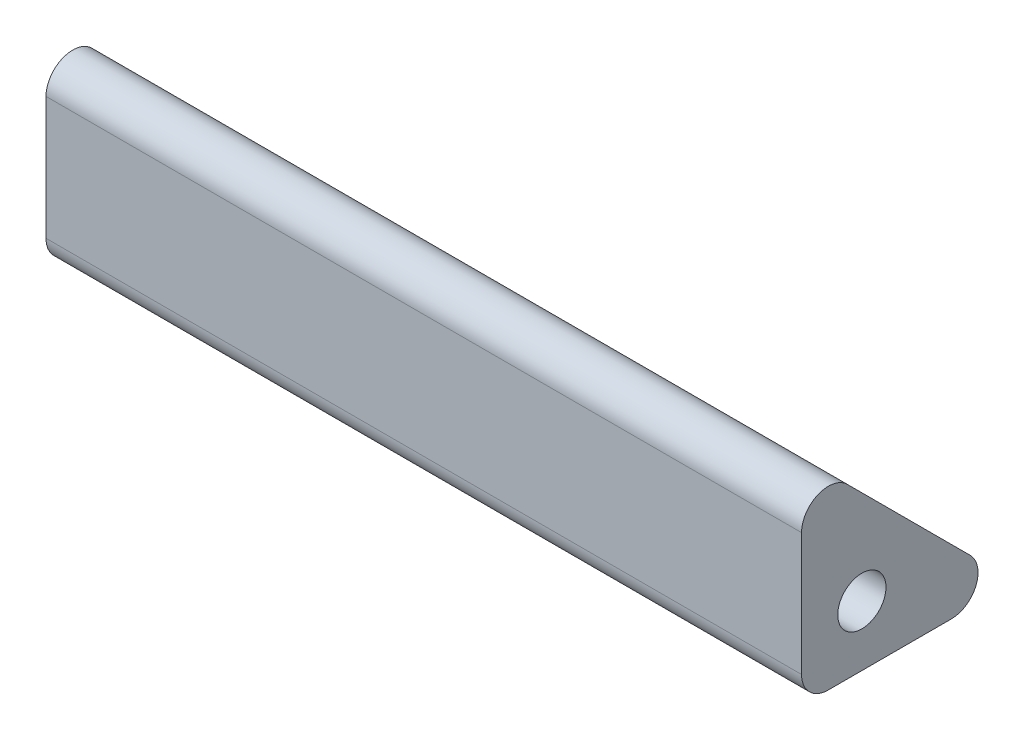
ISO-10303-21;
HEADER;
FILE_DESCRIPTION(('STEP AP214'),'2;1');
FILE_NAME('part.step','',(''),(''),'','','');
FILE_SCHEMA(('AUTOMOTIVE_DESIGN { 1 0 10303 214 1 1 1 1 }'));
ENDSEC;
DATA;
#1=APPLICATION_CONTEXT('core data for automotive mechanical design processes');
#2=APPLICATION_PROTOCOL_DEFINITION('international standard','automotive_design',2000,#1);
#3=PRODUCT_CONTEXT('',#1,'mechanical');
#4=PRODUCT('Part','Part','',(#3));
#5=PRODUCT_RELATED_PRODUCT_CATEGORY('part','',(#4));
#6=PRODUCT_DEFINITION_FORMATION('','',#4);
#7=PRODUCT_DEFINITION_CONTEXT('part definition',#1,'design');
#8=PRODUCT_DEFINITION('design','',#6,#7);
#9=PRODUCT_DEFINITION_SHAPE('','',#8);
#10=(LENGTH_UNIT() NAMED_UNIT(*) SI_UNIT(.MILLI.,.METRE.));
#11=(NAMED_UNIT(*) PLANE_ANGLE_UNIT() SI_UNIT($,.RADIAN.));
#12=(NAMED_UNIT(*) SI_UNIT($,.STERADIAN.) SOLID_ANGLE_UNIT());
#13=UNCERTAINTY_MEASURE_WITH_UNIT(LENGTH_MEASURE(1.E-05),#10,'distance_accuracy_value','');
#14=(GEOMETRIC_REPRESENTATION_CONTEXT(3) GLOBAL_UNCERTAINTY_ASSIGNED_CONTEXT((#13)) GLOBAL_UNIT_ASSIGNED_CONTEXT((#10,
#11,#12)) REPRESENTATION_CONTEXT('',''));
#15=CARTESIAN_POINT('',(0.,0.,0.));
#16=DIRECTION('',(0.,0.,1.));
#17=DIRECTION('',(1.,0.,0.));
#18=AXIS2_PLACEMENT_3D('',#15,#16,#17);
#19=CARTESIAN_POINT('',(28.2,0.,0.));
#20=DIRECTION('',(1.,0.,0.));
#21=DIRECTION('',(0.,0.,-1.));
#22=AXIS2_PLACEMENT_3D('',#19,#20,#21);
#23=PLANE('',#22);
#24=DIRECTION('',(0.,-1.,0.));
#25=VECTOR('',#24,1.);
#26=CARTESIAN_POINT('',(28.2,5.75,2.25));
#27=LINE('',#26,#25);
#28=CARTESIAN_POINT('',(28.2,3.3357864376269,2.25));
#29=VERTEX_POINT('',#28);
#30=CARTESIAN_POINT('',(28.2,-1.25,2.25));
#31=VERTEX_POINT('',#30);
#32=EDGE_CURVE('E132',#29,#31,#27,.T.);
#33=ORIENTED_EDGE('',*,*,#32,.T.);
#34=CARTESIAN_POINT('',(28.2,-1.25,1.25));
#35=DIRECTION('',(1.,0.,0.));
#36=DIRECTION('',(0.,0.,-1.));
#37=AXIS2_PLACEMENT_3D('',#34,#35,#36);
#38=CIRCLE('',#37,1.);
#39=CARTESIAN_POINT('',(28.2,-2.25,1.25));
#40=VERTEX_POINT('',#39);
#41=EDGE_CURVE('E154',#31,#40,#38,.T.);
#42=ORIENTED_EDGE('',*,*,#41,.T.);
#43=DIRECTION('',(0.,0.,-1.));
#44=VECTOR('',#43,1.);
#45=CARTESIAN_POINT('',(28.2,-2.25,2.25));
#46=LINE('',#45,#44);
#47=CARTESIAN_POINT('',(28.2,-2.25,-3.3357864376269));
#48=VERTEX_POINT('',#47);
#49=EDGE_CURVE('E118',#40,#48,#46,.T.);
#50=ORIENTED_EDGE('',*,*,#49,.T.);
#51=CARTESIAN_POINT('',(28.2,-1.25,-3.3357864376269));
#52=DIRECTION('',(1.,0.,0.));
#53=DIRECTION('',(0.,0.,-1.));
#54=AXIS2_PLACEMENT_3D('',#51,#52,#53);
#55=CIRCLE('',#54,1.);
#56=CARTESIAN_POINT('',(28.2,-0.542893218813454,-4.04289321881345));
#57=VERTEX_POINT('',#56);
#58=EDGE_CURVE('E65',#48,#57,#55,.T.);
#59=ORIENTED_EDGE('',*,*,#58,.T.);
#60=DIRECTION('',(0.,0.707106781186548,0.707106781186548));
#61=VECTOR('',#60,1.);
#62=CARTESIAN_POINT('',(28.2,5.75,2.25));
#63=LINE('',#62,#61);
#64=CARTESIAN_POINT('',(28.2,4.04289321881345,0.542893218813452));
#65=VERTEX_POINT('',#64);
#66=EDGE_CURVE('E127',#57,#65,#63,.T.);
#67=ORIENTED_EDGE('',*,*,#66,.T.);
#68=CARTESIAN_POINT('',(28.2,3.3357864376269,1.25));
#69=DIRECTION('',(1.,0.,0.));
#70=DIRECTION('',(0.,0.,-1.));
#71=AXIS2_PLACEMENT_3D('',#68,#69,#70);
#72=CIRCLE('',#71,1.);
#73=EDGE_CURVE('E149',#65,#29,#72,.T.);
#74=ORIENTED_EDGE('',*,*,#73,.T.);
#75=EDGE_LOOP('',(#33,#42,#50,#59,#67,#74));
#76=FACE_BOUND('',#75,.T.);
#77=CARTESIAN_POINT('',(28.2,0.,0.));
#78=DIRECTION('',(1.,0.,0.));
#79=DIRECTION('',(0.,0.,-1.));
#80=AXIS2_PLACEMENT_3D('',#77,#78,#79);
#81=CIRCLE('',#80,0.9);
#82=CARTESIAN_POINT('',(28.2,0.,-0.9));
#83=VERTEX_POINT('',#82);
#84=EDGE_CURVE('E165',#83,#83,#81,.T.);
#85=ORIENTED_EDGE('',*,*,#84,.F.);
#86=EDGE_LOOP('',(#85));
#87=FACE_BOUND('',#86,.T.);
#88=ADVANCED_FACE('F43',(#76,#87),#23,.T.);
#89=CARTESIAN_POINT('',(0.,0.,0.));
#90=DIRECTION('',(1.,0.,0.));
#91=DIRECTION('',(0.,0.,-1.));
#92=AXIS2_PLACEMENT_3D('',#89,#90,#91);
#93=PLANE('',#92);
#94=DIRECTION('',(0.,0.,-1.));
#95=VECTOR('',#94,1.);
#96=CARTESIAN_POINT('',(0.,-2.25,2.25));
#97=LINE('',#96,#95);
#98=CARTESIAN_POINT('',(0.,-2.25,1.25));
#99=VERTEX_POINT('',#98);
#100=CARTESIAN_POINT('',(0.,-2.25,-3.3357864376269));
#101=VERTEX_POINT('',#100);
#102=EDGE_CURVE('E116',#99,#101,#97,.T.);
#103=ORIENTED_EDGE('',*,*,#102,.F.);
#104=CARTESIAN_POINT('',(0.,-1.25,1.25));
#105=DIRECTION('',(1.,0.,0.));
#106=DIRECTION('',(0.,0.,-1.));
#107=AXIS2_PLACEMENT_3D('',#104,#105,#106);
#108=CIRCLE('',#107,1.);
#109=CARTESIAN_POINT('',(0.,-1.25,2.25));
#110=VERTEX_POINT('',#109);
#111=EDGE_CURVE('E98',#99,#110,#108,.F.);
#112=ORIENTED_EDGE('',*,*,#111,.T.);
#113=DIRECTION('',(0.,-1.,0.));
#114=VECTOR('',#113,1.);
#115=CARTESIAN_POINT('',(0.,5.75,2.25));
#116=LINE('',#115,#114);
#117=CARTESIAN_POINT('',(0.,3.3357864376269,2.25));
#118=VERTEX_POINT('',#117);
#119=EDGE_CURVE('E128',#118,#110,#116,.T.);
#120=ORIENTED_EDGE('',*,*,#119,.F.);
#121=CARTESIAN_POINT('',(0.,3.3357864376269,1.25));
#122=DIRECTION('',(1.,0.,0.));
#123=DIRECTION('',(0.,0.,-1.));
#124=AXIS2_PLACEMENT_3D('',#121,#122,#123);
#125=CIRCLE('',#124,1.);
#126=CARTESIAN_POINT('',(0.,4.04289321881345,0.542893218813452));
#127=VERTEX_POINT('',#126);
#128=EDGE_CURVE('E120',#118,#127,#125,.F.);
#129=ORIENTED_EDGE('',*,*,#128,.T.);
#130=DIRECTION('',(0.,0.707106781186548,0.707106781186548));
#131=VECTOR('',#130,1.);
#132=CARTESIAN_POINT('',(0.,5.75,2.25));
#133=LINE('',#132,#131);
#134=CARTESIAN_POINT('',(0.,-0.542893218813454,-4.04289321881345));
#135=VERTEX_POINT('',#134);
#136=EDGE_CURVE('E134',#135,#127,#133,.T.);
#137=ORIENTED_EDGE('',*,*,#136,.F.);
#138=CARTESIAN_POINT('',(0.,-1.25,-3.3357864376269));
#139=DIRECTION('',(1.,0.,0.));
#140=DIRECTION('',(0.,0.,-1.));
#141=AXIS2_PLACEMENT_3D('',#138,#139,#140);
#142=CIRCLE('',#141,1.);
#143=EDGE_CURVE('E110',#135,#101,#142,.F.);
#144=ORIENTED_EDGE('',*,*,#143,.T.);
#145=EDGE_LOOP('',(#103,#112,#120,#129,#137,#144));
#146=FACE_BOUND('',#145,.T.);
#147=CARTESIAN_POINT('',(0.,0.,0.));
#148=DIRECTION('',(1.,0.,0.));
#149=DIRECTION('',(0.,0.,-1.));
#150=AXIS2_PLACEMENT_3D('',#147,#148,#149);
#151=CIRCLE('',#150,0.9);
#152=CARTESIAN_POINT('',(0.,0.,-0.9));
#153=VERTEX_POINT('',#152);
#154=EDGE_CURVE('E168',#153,#153,#151,.T.);
#155=ORIENTED_EDGE('',*,*,#154,.T.);
#156=EDGE_LOOP('',(#155));
#157=FACE_BOUND('',#156,.T.);
#158=ADVANCED_FACE('F123',(#146,#157),#93,.F.);
#159=CARTESIAN_POINT('',(28.2,5.75,2.25));
#160=DIRECTION('',(0.,-0.707106781186547,0.707106781186547));
#161=DIRECTION('',(0.,-0.707106781186548,-0.707106781186548));
#162=AXIS2_PLACEMENT_3D('',#159,#160,#161);
#163=PLANE('',#162);
#164=ORIENTED_EDGE('',*,*,#66,.F.);
#165=DIRECTION('',(-1.,0.,0.));
#166=VECTOR('',#165,1.);
#167=CARTESIAN_POINT('',(28.2,-0.542893218813453,-4.04289321881345));
#168=LINE('',#167,#166);
#169=EDGE_CURVE('E11',#57,#135,#168,.T.);
#170=ORIENTED_EDGE('',*,*,#169,.T.);
#171=ORIENTED_EDGE('',*,*,#136,.T.);
#172=DIRECTION('',(-1.,0.,0.));
#173=VECTOR('',#172,1.);
#174=CARTESIAN_POINT('',(28.2,4.04289321881345,0.542893218813453));
#175=LINE('',#174,#173);
#176=EDGE_CURVE('E52',#127,#65,#175,.F.);
#177=ORIENTED_EDGE('',*,*,#176,.T.);
#178=EDGE_LOOP('',(#164,#170,#171,#177));
#179=FACE_BOUND('',#178,.T.);
#180=ADVANCED_FACE('F192',(#179),#163,.F.);
#181=CARTESIAN_POINT('',(28.2,5.75,2.25));
#182=DIRECTION('',(0.,0.,-1.));
#183=DIRECTION('',(0.,1.,0.));
#184=AXIS2_PLACEMENT_3D('',#181,#182,#183);
#185=PLANE('',#184);
#186=ORIENTED_EDGE('',*,*,#119,.T.);
#187=DIRECTION('',(-1.,0.,0.));
#188=VECTOR('',#187,1.);
#189=CARTESIAN_POINT('',(28.2,-1.25,2.25));
#190=LINE('',#189,#188);
#191=EDGE_CURVE('E103',#110,#31,#190,.F.);
#192=ORIENTED_EDGE('',*,*,#191,.T.);
#193=ORIENTED_EDGE('',*,*,#32,.F.);
#194=DIRECTION('',(-1.,0.,0.));
#195=VECTOR('',#194,1.);
#196=CARTESIAN_POINT('',(28.2,3.3357864376269,2.25));
#197=LINE('',#196,#195);
#198=EDGE_CURVE('E109',#29,#118,#197,.T.);
#199=ORIENTED_EDGE('',*,*,#198,.T.);
#200=EDGE_LOOP('',(#186,#192,#193,#199));
#201=FACE_BOUND('',#200,.T.);
#202=ADVANCED_FACE('F185',(#201),#185,.F.);
#203=CARTESIAN_POINT('',(28.2,-2.25,2.25));
#204=DIRECTION('',(0.,1.,0.));
#205=DIRECTION('',(0.,0.,1.));
#206=AXIS2_PLACEMENT_3D('',#203,#204,#205);
#207=PLANE('',#206);
#208=ORIENTED_EDGE('',*,*,#49,.F.);
#209=DIRECTION('',(-1.,0.,0.));
#210=VECTOR('',#209,1.);
#211=CARTESIAN_POINT('',(28.2,-2.25,1.25));
#212=LINE('',#211,#210);
#213=EDGE_CURVE('E102',#40,#99,#212,.T.);
#214=ORIENTED_EDGE('',*,*,#213,.T.);
#215=ORIENTED_EDGE('',*,*,#102,.T.);
#216=DIRECTION('',(-1.,0.,0.));
#217=VECTOR('',#216,1.);
#218=CARTESIAN_POINT('',(28.2,-2.25,-3.3357864376269));
#219=LINE('',#218,#217);
#220=EDGE_CURVE('E121',#101,#48,#219,.F.);
#221=ORIENTED_EDGE('',*,*,#220,.T.);
#222=EDGE_LOOP('',(#208,#214,#215,#221));
#223=FACE_BOUND('',#222,.T.);
#224=ADVANCED_FACE('F115',(#223),#207,.F.);
#225=CARTESIAN_POINT('',(28.2,0.,0.));
#226=DIRECTION('',(-1.,0.,0.));
#227=DIRECTION('',(0.,0.,1.));
#228=AXIS2_PLACEMENT_3D('',#225,#226,#227);
#229=CYLINDRICAL_SURFACE('',#228,0.9);
#230=ORIENTED_EDGE('',*,*,#84,.T.);
#231=EDGE_LOOP('',(#230));
#232=FACE_BOUND('',#231,.T.);
#233=ORIENTED_EDGE('',*,*,#154,.F.);
#234=EDGE_LOOP('',(#233));
#235=FACE_BOUND('',#234,.T.);
#236=ADVANCED_FACE('F176',(#232,#235),#229,.F.);
#237=CARTESIAN_POINT('',(28.2,-1.25,1.25));
#238=DIRECTION('',(-1.,0.,0.));
#239=DIRECTION('',(0.,0.,1.));
#240=AXIS2_PLACEMENT_3D('',#237,#238,#239);
#241=CYLINDRICAL_SURFACE('',#240,1.);
#242=ORIENTED_EDGE('',*,*,#41,.F.);
#243=ORIENTED_EDGE('',*,*,#191,.F.);
#244=ORIENTED_EDGE('',*,*,#111,.F.);
#245=ORIENTED_EDGE('',*,*,#213,.F.);
#246=EDGE_LOOP('',(#242,#243,#244,#245));
#247=FACE_BOUND('',#246,.T.);
#248=ADVANCED_FACE('F101',(#247),#241,.T.);
#249=CARTESIAN_POINT('',(28.2,-1.25,-3.3357864376269));
#250=DIRECTION('',(-1.,0.,0.));
#251=DIRECTION('',(0.,0.,1.));
#252=AXIS2_PLACEMENT_3D('',#249,#250,#251);
#253=CYLINDRICAL_SURFACE('',#252,1.);
#254=ORIENTED_EDGE('',*,*,#58,.F.);
#255=ORIENTED_EDGE('',*,*,#220,.F.);
#256=ORIENTED_EDGE('',*,*,#143,.F.);
#257=ORIENTED_EDGE('',*,*,#169,.F.);
#258=EDGE_LOOP('',(#254,#255,#256,#257));
#259=FACE_BOUND('',#258,.T.);
#260=ADVANCED_FACE('F183',(#259),#253,.T.);
#261=CARTESIAN_POINT('',(28.2,3.3357864376269,1.25));
#262=DIRECTION('',(-1.,0.,0.));
#263=DIRECTION('',(0.,0.,1.));
#264=AXIS2_PLACEMENT_3D('',#261,#262,#263);
#265=CYLINDRICAL_SURFACE('',#264,1.);
#266=ORIENTED_EDGE('',*,*,#73,.F.);
#267=ORIENTED_EDGE('',*,*,#176,.F.);
#268=ORIENTED_EDGE('',*,*,#128,.F.);
#269=ORIENTED_EDGE('',*,*,#198,.F.);
#270=EDGE_LOOP('',(#266,#267,#268,#269));
#271=FACE_BOUND('',#270,.T.);
#272=ADVANCED_FACE('F45',(#271),#265,.T.);
#273=CLOSED_SHELL('',(#88,#158,#180,#202,#224,#236,#248,#260,#272));
#274=MANIFOLD_SOLID_BREP('B2',#273);
#275=ADVANCED_BREP_SHAPE_REPRESENTATION('',(#18,#274),#14);
#276=SHAPE_DEFINITION_REPRESENTATION(#9,#275);
ENDSEC;
END-ISO-10303-21;
